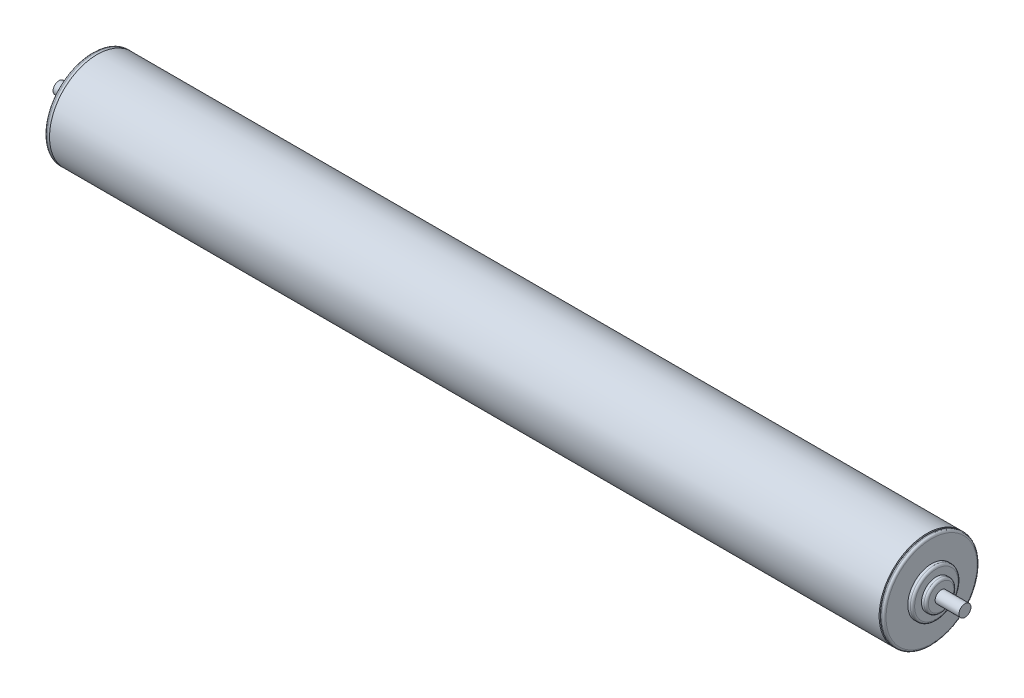
ISO-10303-21;
HEADER;
FILE_DESCRIPTION(('STEP AP214'),'2;1');
FILE_NAME('part.step','',(''),(''),'','','');
FILE_SCHEMA(('AUTOMOTIVE_DESIGN { 1 0 10303 214 1 1 1 1 }'));
ENDSEC;
DATA;
#1=APPLICATION_CONTEXT('core data for automotive mechanical design processes');
#2=APPLICATION_PROTOCOL_DEFINITION('international standard','automotive_design',2000,#1);
#3=PRODUCT_CONTEXT('',#1,'mechanical');
#4=PRODUCT('Part','Part','',(#3));
#5=PRODUCT_RELATED_PRODUCT_CATEGORY('part','',(#4));
#6=PRODUCT_DEFINITION_FORMATION('','',#4);
#7=PRODUCT_DEFINITION_CONTEXT('part definition',#1,'design');
#8=PRODUCT_DEFINITION('design','',#6,#7);
#9=PRODUCT_DEFINITION_SHAPE('','',#8);
#10=(LENGTH_UNIT() NAMED_UNIT(*) SI_UNIT(.MILLI.,.METRE.));
#11=(NAMED_UNIT(*) PLANE_ANGLE_UNIT() SI_UNIT($,.RADIAN.));
#12=(NAMED_UNIT(*) SI_UNIT($,.STERADIAN.) SOLID_ANGLE_UNIT());
#13=UNCERTAINTY_MEASURE_WITH_UNIT(LENGTH_MEASURE(1.E-05),#10,'distance_accuracy_value','');
#14=(GEOMETRIC_REPRESENTATION_CONTEXT(3) GLOBAL_UNCERTAINTY_ASSIGNED_CONTEXT((#13)) GLOBAL_UNIT_ASSIGNED_CONTEXT((#10,
#11,#12)) REPRESENTATION_CONTEXT('',''));
#15=CARTESIAN_POINT('',(0.,0.,0.));
#16=DIRECTION('',(0.,0.,1.));
#17=DIRECTION('',(1.,0.,0.));
#18=AXIS2_PLACEMENT_3D('',#15,#16,#17);
#19=CARTESIAN_POINT('',(-228.6,0.,0.));
#20=DIRECTION('',(1.,0.,0.));
#21=DIRECTION('',(0.,0.,-1.));
#22=AXIS2_PLACEMENT_3D('',#19,#20,#21);
#23=PLANE('',#22);
#24=CARTESIAN_POINT('',(-228.6,0.,0.));
#25=DIRECTION('',(1.,0.,0.));
#26=DIRECTION('',(0.,0.,-1.));
#27=AXIS2_PLACEMENT_3D('',#24,#25,#26);
#28=CIRCLE('',#27,6.79450000000001);
#29=CARTESIAN_POINT('',(-228.6,0.,-6.79450000000001));
#30=VERTEX_POINT('',#29);
#31=EDGE_CURVE('E47',#30,#30,#28,.F.);
#32=ORIENTED_EDGE('',*,*,#31,.T.);
#33=EDGE_LOOP('',(#32));
#34=FACE_BOUND('',#33,.T.);
#35=CARTESIAN_POINT('',(-228.6,0.,0.));
#36=DIRECTION('',(1.,0.,0.));
#37=DIRECTION('',(0.,0.,-1.));
#38=AXIS2_PLACEMENT_3D('',#35,#36,#37);
#39=CIRCLE('',#38,3.175);
#40=CARTESIAN_POINT('',(-228.6,0.,-3.175));
#41=VERTEX_POINT('',#40);
#42=EDGE_CURVE('E39',#41,#41,#39,.F.);
#43=ORIENTED_EDGE('',*,*,#42,.F.);
#44=EDGE_LOOP('',(#43));
#45=FACE_BOUND('',#44,.T.);
#46=ADVANCED_FACE('F32',(#34,#45),#23,.F.);
#47=CARTESIAN_POINT('',(-228.6,0.,0.));
#48=DIRECTION('',(-1.,0.,0.));
#49=DIRECTION('',(0.,0.,1.));
#50=AXIS2_PLACEMENT_3D('',#47,#48,#49);
#51=CYLINDRICAL_SURFACE('',#50,7.93750000000001);
#52=CARTESIAN_POINT('',(-227.457,0.,0.));
#53=DIRECTION('',(1.,0.,0.));
#54=DIRECTION('',(0.,0.,-1.));
#55=AXIS2_PLACEMENT_3D('',#52,#53,#54);
#56=CIRCLE('',#55,7.93750000000001);
#57=CARTESIAN_POINT('',(-227.457,0.,-7.93750000000001));
#58=VERTEX_POINT('',#57);
#59=EDGE_CURVE('E43',#58,#58,#56,.T.);
#60=ORIENTED_EDGE('',*,*,#59,.T.);
#61=EDGE_LOOP('',(#60));
#62=FACE_BOUND('',#61,.T.);
#63=CARTESIAN_POINT('',(-226.06,0.,0.));
#64=DIRECTION('',(-1.,0.,0.));
#65=DIRECTION('',(0.,0.,1.));
#66=AXIS2_PLACEMENT_3D('',#63,#64,#65);
#67=CIRCLE('',#66,7.93750000000001);
#68=CARTESIAN_POINT('',(-226.06,0.,7.93750000000001));
#69=VERTEX_POINT('',#68);
#70=EDGE_CURVE('E70',#69,#69,#67,.T.);
#71=ORIENTED_EDGE('',*,*,#70,.T.);
#72=EDGE_LOOP('',(#71));
#73=FACE_BOUND('',#72,.T.);
#74=ADVANCED_FACE('F131',(#62,#73),#51,.T.);
#75=CARTESIAN_POINT('',(-226.06,-7.93750000000001,0.));
#76=DIRECTION('',(1.,0.,0.));
#77=DIRECTION('',(0.,0.,-1.));
#78=AXIS2_PLACEMENT_3D('',#75,#76,#77);
#79=PLANE('',#78);
#80=CARTESIAN_POINT('',(-226.06,0.,0.));
#81=DIRECTION('',(1.,0.,0.));
#82=DIRECTION('',(0.,0.,-1.));
#83=AXIS2_PLACEMENT_3D('',#80,#81,#82);
#84=CIRCLE('',#83,11.557);
#85=CARTESIAN_POINT('',(-226.06,0.,-11.557));
#86=VERTEX_POINT('',#85);
#87=EDGE_CURVE('E55',#86,#86,#84,.F.);
#88=ORIENTED_EDGE('',*,*,#87,.T.);
#89=EDGE_LOOP('',(#88));
#90=FACE_BOUND('',#89,.T.);
#91=ORIENTED_EDGE('',*,*,#70,.F.);
#92=EDGE_LOOP('',(#91));
#93=FACE_BOUND('',#92,.T.);
#94=ADVANCED_FACE('F137',(#90,#93),#79,.F.);
#95=CARTESIAN_POINT('',(-228.6,0.,0.));
#96=DIRECTION('',(-1.,0.,0.));
#97=DIRECTION('',(0.,0.,1.));
#98=AXIS2_PLACEMENT_3D('',#95,#96,#97);
#99=CYLINDRICAL_SURFACE('',#98,12.7);
#100=CARTESIAN_POINT('',(-224.917,0.,0.));
#101=DIRECTION('',(1.,0.,0.));
#102=DIRECTION('',(0.,0.,-1.));
#103=AXIS2_PLACEMENT_3D('',#100,#101,#102);
#104=CIRCLE('',#103,12.7);
#105=CARTESIAN_POINT('',(-224.917,0.,-12.7));
#106=VERTEX_POINT('',#105);
#107=EDGE_CURVE('E52',#106,#106,#104,.T.);
#108=ORIENTED_EDGE('',*,*,#107,.T.);
#109=EDGE_LOOP('',(#108));
#110=FACE_BOUND('',#109,.T.);
#111=CARTESIAN_POINT('',(-223.52,0.,0.));
#112=DIRECTION('',(-1.,0.,0.));
#113=DIRECTION('',(0.,0.,1.));
#114=AXIS2_PLACEMENT_3D('',#111,#112,#113);
#115=CIRCLE('',#114,12.7);
#116=CARTESIAN_POINT('',(-223.52,0.,12.7));
#117=VERTEX_POINT('',#116);
#118=EDGE_CURVE('E73',#117,#117,#115,.T.);
#119=ORIENTED_EDGE('',*,*,#118,.T.);
#120=EDGE_LOOP('',(#119));
#121=FACE_BOUND('',#120,.T.);
#122=ADVANCED_FACE('F165',(#110,#121),#99,.T.);
#123=CARTESIAN_POINT('',(-223.52,-12.7,0.));
#124=DIRECTION('',(1.,0.,0.));
#125=DIRECTION('',(0.,0.,-1.));
#126=AXIS2_PLACEMENT_3D('',#123,#124,#125);
#127=PLANE('',#126);
#128=CARTESIAN_POINT('',(-223.52,0.,0.));
#129=DIRECTION('',(1.,0.,0.));
#130=DIRECTION('',(0.,0.,-1.));
#131=AXIS2_PLACEMENT_3D('',#128,#129,#130);
#132=CIRCLE('',#131,24.257);
#133=CARTESIAN_POINT('',(-223.52,0.,-24.257));
#134=VERTEX_POINT('',#133);
#135=EDGE_CURVE('E58',#134,#134,#132,.F.);
#136=ORIENTED_EDGE('',*,*,#135,.T.);
#137=EDGE_LOOP('',(#136));
#138=FACE_BOUND('',#137,.T.);
#139=ORIENTED_EDGE('',*,*,#118,.F.);
#140=EDGE_LOOP('',(#139));
#141=FACE_BOUND('',#140,.T.);
#142=ADVANCED_FACE('F171',(#138,#141),#127,.F.);
#143=CARTESIAN_POINT('',(-228.6,0.,0.));
#144=DIRECTION('',(-1.,0.,0.));
#145=DIRECTION('',(0.,0.,1.));
#146=AXIS2_PLACEMENT_3D('',#143,#144,#145);
#147=CYLINDRICAL_SURFACE('',#146,25.4);
#148=CARTESIAN_POINT('',(-222.123,0.,0.));
#149=DIRECTION('',(-1.,0.,0.));
#150=DIRECTION('',(0.,0.,1.));
#151=AXIS2_PLACEMENT_3D('',#148,#149,#150);
#152=CIRCLE('',#151,25.4);
#153=CARTESIAN_POINT('',(-222.123,0.,25.4));
#154=VERTEX_POINT('',#153);
#155=EDGE_CURVE('E64',#154,#154,#152,.T.);
#156=ORIENTED_EDGE('',*,*,#155,.T.);
#157=EDGE_LOOP('',(#156));
#158=FACE_BOUND('',#157,.T.);
#159=CARTESIAN_POINT('',(-222.377,0.,0.));
#160=DIRECTION('',(1.,0.,0.));
#161=DIRECTION('',(0.,0.,-1.));
#162=AXIS2_PLACEMENT_3D('',#159,#160,#161);
#163=CIRCLE('',#162,25.4);
#164=CARTESIAN_POINT('',(-222.377,0.,-25.4));
#165=VERTEX_POINT('',#164);
#166=EDGE_CURVE('E67',#165,#165,#163,.T.);
#167=ORIENTED_EDGE('',*,*,#166,.T.);
#168=EDGE_LOOP('',(#167));
#169=FACE_BOUND('',#168,.T.);
#170=ADVANCED_FACE('F147',(#158,#169),#147,.T.);
#171=CARTESIAN_POINT('',(-222.123,0.,0.));
#172=DIRECTION('',(-1.,0.,0.));
#173=DIRECTION('',(0.,0.,1.));
#174=AXIS2_PLACEMENT_3D('',#171,#172,#173);
#175=TOROIDAL_SURFACE('',#174,24.257,1.143);
#176=CARTESIAN_POINT('',(-220.98,0.,0.));
#177=DIRECTION('',(-1.,0.,0.));
#178=DIRECTION('',(0.,0.,1.));
#179=AXIS2_PLACEMENT_3D('',#176,#177,#178);
#180=CIRCLE('',#179,24.257);
#181=CARTESIAN_POINT('',(-220.98,0.,24.257));
#182=VERTEX_POINT('',#181);
#183=EDGE_CURVE('E61',#182,#182,#180,.F.);
#184=ORIENTED_EDGE('',*,*,#183,.F.);
#185=EDGE_LOOP('',(#184));
#186=FACE_BOUND('',#185,.T.);
#187=ORIENTED_EDGE('',*,*,#155,.F.);
#188=EDGE_LOOP('',(#187));
#189=FACE_BOUND('',#188,.T.);
#190=ADVANCED_FACE('F143',(#186,#189),#175,.T.);
#191=CARTESIAN_POINT('',(-222.377,0.,0.));
#192=DIRECTION('',(1.,0.,0.));
#193=DIRECTION('',(0.,0.,-1.));
#194=AXIS2_PLACEMENT_3D('',#191,#192,#193);
#195=TOROIDAL_SURFACE('',#194,24.257,1.143);
#196=ORIENTED_EDGE('',*,*,#166,.F.);
#197=EDGE_LOOP('',(#196));
#198=FACE_BOUND('',#197,.T.);
#199=ORIENTED_EDGE('',*,*,#135,.F.);
#200=EDGE_LOOP('',(#199));
#201=FACE_BOUND('',#200,.T.);
#202=ADVANCED_FACE('F146',(#198,#201),#195,.T.);
#203=CARTESIAN_POINT('',(-224.917,0.,0.));
#204=DIRECTION('',(1.,0.,0.));
#205=DIRECTION('',(0.,0.,-1.));
#206=AXIS2_PLACEMENT_3D('',#203,#204,#205);
#207=TOROIDAL_SURFACE('',#206,11.557,1.143);
#208=ORIENTED_EDGE('',*,*,#107,.F.);
#209=EDGE_LOOP('',(#208));
#210=FACE_BOUND('',#209,.T.);
#211=ORIENTED_EDGE('',*,*,#87,.F.);
#212=EDGE_LOOP('',(#211));
#213=FACE_BOUND('',#212,.T.);
#214=ADVANCED_FACE('F150',(#210,#213),#207,.T.);
#215=CARTESIAN_POINT('',(-227.457,0.,0.));
#216=DIRECTION('',(1.,0.,0.));
#217=DIRECTION('',(0.,0.,-1.));
#218=AXIS2_PLACEMENT_3D('',#215,#216,#217);
#219=TOROIDAL_SURFACE('',#218,6.79450000000001,1.143);
#220=ORIENTED_EDGE('',*,*,#59,.F.);
#221=EDGE_LOOP('',(#220));
#222=FACE_BOUND('',#221,.T.);
#223=ORIENTED_EDGE('',*,*,#31,.F.);
#224=EDGE_LOOP('',(#223));
#225=FACE_BOUND('',#224,.T.);
#226=ADVANCED_FACE('F34',(#222,#225),#219,.T.);
#227=CARTESIAN_POINT('',(-241.3,0.,0.));
#228=DIRECTION('',(1.,0.,0.));
#229=DIRECTION('',(0.,0.,-1.));
#230=AXIS2_PLACEMENT_3D('',#227,#228,#229);
#231=CYLINDRICAL_SURFACE('',#230,3.175);
#232=CARTESIAN_POINT('',(-241.3,0.,0.));
#233=DIRECTION('',(-1.,0.,0.));
#234=DIRECTION('',(0.,0.,1.));
#235=AXIS2_PLACEMENT_3D('',#232,#233,#234);
#236=CIRCLE('',#235,3.175);
#237=CARTESIAN_POINT('',(-241.3,0.,3.175));
#238=VERTEX_POINT('',#237);
#239=EDGE_CURVE('E76',#238,#238,#236,.T.);
#240=ORIENTED_EDGE('',*,*,#239,.F.);
#241=EDGE_LOOP('',(#240));
#242=FACE_BOUND('',#241,.T.);
#243=ORIENTED_EDGE('',*,*,#42,.T.);
#244=EDGE_LOOP('',(#243));
#245=FACE_BOUND('',#244,.T.);
#246=ADVANCED_FACE('F157',(#242,#245),#231,.T.);
#247=CARTESIAN_POINT('',(-241.3,0.,0.));
#248=DIRECTION('',(-1.,0.,0.));
#249=DIRECTION('',(0.,0.,1.));
#250=AXIS2_PLACEMENT_3D('',#247,#248,#249);
#251=PLANE('',#250);
#252=ORIENTED_EDGE('',*,*,#239,.T.);
#253=EDGE_LOOP('',(#252));
#254=FACE_BOUND('',#253,.T.);
#255=ADVANCED_FACE('F183',(#254),#251,.T.);
#256=CARTESIAN_POINT('',(-220.98,-25.4,1.77367252013231E-13));
#257=DIRECTION('',(-1.,0.,0.));
#258=DIRECTION('',(0.,0.,1.));
#259=AXIS2_PLACEMENT_3D('',#256,#257,#258);
#260=PLANE('',#259);
#261=ORIENTED_EDGE('',*,*,#183,.T.);
#262=EDGE_LOOP('',(#261));
#263=FACE_BOUND('',#262,.T.);
#264=CARTESIAN_POINT('',(-220.98,0.,0.));
#265=DIRECTION('',(-1.,0.,0.));
#266=DIRECTION('',(0.,0.,1.));
#267=AXIS2_PLACEMENT_3D('',#264,#265,#266);
#268=CIRCLE('',#267,25.4);
#269=CARTESIAN_POINT('',(-220.98,0.,25.4));
#270=VERTEX_POINT('',#269);
#271=EDGE_CURVE('E79',#270,#270,#268,.F.);
#272=ORIENTED_EDGE('',*,*,#271,.F.);
#273=EDGE_LOOP('',(#272));
#274=FACE_BOUND('',#273,.T.);
#275=ADVANCED_FACE('F187',(#263,#274),#260,.T.);
#276=CARTESIAN_POINT('',(-292.822048968553,0.,0.));
#277=DIRECTION('',(1.,0.,0.));
#278=DIRECTION('',(0.,0.,-1.));
#279=AXIS2_PLACEMENT_3D('',#276,#277,#278);
#280=CYLINDRICAL_SURFACE('',#279,25.4);
#281=ORIENTED_EDGE('',*,*,#271,.T.);
#282=EDGE_LOOP('',(#281));
#283=FACE_BOUND('',#282,.T.);
#284=CARTESIAN_POINT('',(220.98,0.,0.));
#285=DIRECTION('',(1.,0.,0.));
#286=DIRECTION('',(0.,0.,-1.));
#287=AXIS2_PLACEMENT_3D('',#284,#285,#286);
#288=CIRCLE('',#287,25.4);
#289=CARTESIAN_POINT('',(220.98,0.,-25.4));
#290=VERTEX_POINT('',#289);
#291=EDGE_CURVE('E82',#290,#290,#288,.T.);
#292=ORIENTED_EDGE('',*,*,#291,.F.);
#293=EDGE_LOOP('',(#292));
#294=FACE_BOUND('',#293,.T.);
#295=ADVANCED_FACE('F191',(#283,#294),#280,.T.);
#296=CARTESIAN_POINT('',(220.98,-25.4,1.77367252013231E-13));
#297=DIRECTION('',(1.,0.,0.));
#298=DIRECTION('',(0.,0.,1.));
#299=AXIS2_PLACEMENT_3D('',#296,#297,#298);
#300=PLANE('',#299);
#301=CARTESIAN_POINT('',(220.98,0.,0.));
#302=DIRECTION('',(1.,0.,0.));
#303=DIRECTION('',(0.,0.,-1.));
#304=AXIS2_PLACEMENT_3D('',#301,#302,#303);
#305=CIRCLE('',#304,24.257);
#306=CARTESIAN_POINT('',(220.98,0.,-24.257));
#307=VERTEX_POINT('',#306);
#308=EDGE_CURVE('E10',#307,#307,#305,.T.);
#309=ORIENTED_EDGE('',*,*,#308,.F.);
#310=EDGE_LOOP('',(#309));
#311=FACE_BOUND('',#310,.T.);
#312=ORIENTED_EDGE('',*,*,#291,.T.);
#313=EDGE_LOOP('',(#312));
#314=FACE_BOUND('',#313,.T.);
#315=ADVANCED_FACE('F195',(#311,#314),#300,.T.);
#316=CARTESIAN_POINT('',(228.6,0.,0.));
#317=DIRECTION('',(-1.,0.,0.));
#318=DIRECTION('',(0.,0.,-1.));
#319=AXIS2_PLACEMENT_3D('',#316,#317,#318);
#320=PLANE('',#319);
#321=CARTESIAN_POINT('',(228.6,0.,0.));
#322=DIRECTION('',(1.,0.,0.));
#323=DIRECTION('',(0.,0.,-1.));
#324=AXIS2_PLACEMENT_3D('',#321,#322,#323);
#325=CIRCLE('',#324,6.79450000000001);
#326=CARTESIAN_POINT('',(228.6,0.,-6.79450000000001));
#327=VERTEX_POINT('',#326);
#328=EDGE_CURVE('E91',#327,#327,#325,.F.);
#329=ORIENTED_EDGE('',*,*,#328,.F.);
#330=EDGE_LOOP('',(#329));
#331=FACE_BOUND('',#330,.T.);
#332=CARTESIAN_POINT('',(228.6,0.,0.));
#333=DIRECTION('',(1.,0.,0.));
#334=DIRECTION('',(0.,0.,-1.));
#335=AXIS2_PLACEMENT_3D('',#332,#333,#334);
#336=CIRCLE('',#335,3.175);
#337=CARTESIAN_POINT('',(228.6,0.,-3.175));
#338=VERTEX_POINT('',#337);
#339=EDGE_CURVE('E85',#338,#338,#336,.F.);
#340=ORIENTED_EDGE('',*,*,#339,.T.);
#341=EDGE_LOOP('',(#340));
#342=FACE_BOUND('',#341,.T.);
#343=ADVANCED_FACE('F199',(#331,#342),#320,.F.);
#344=CARTESIAN_POINT('',(228.6,0.,0.));
#345=DIRECTION('',(1.,0.,0.));
#346=DIRECTION('',(0.,0.,1.));
#347=AXIS2_PLACEMENT_3D('',#344,#345,#346);
#348=CYLINDRICAL_SURFACE('',#347,7.93750000000001);
#349=CARTESIAN_POINT('',(227.457,0.,0.));
#350=DIRECTION('',(1.,0.,0.));
#351=DIRECTION('',(0.,0.,-1.));
#352=AXIS2_PLACEMENT_3D('',#349,#350,#351);
#353=CIRCLE('',#352,7.93750000000001);
#354=CARTESIAN_POINT('',(227.457,0.,-7.93750000000001));
#355=VERTEX_POINT('',#354);
#356=EDGE_CURVE('E88',#355,#355,#353,.T.);
#357=ORIENTED_EDGE('',*,*,#356,.F.);
#358=EDGE_LOOP('',(#357));
#359=FACE_BOUND('',#358,.T.);
#360=CARTESIAN_POINT('',(226.06,0.,0.));
#361=DIRECTION('',(-1.,0.,0.));
#362=DIRECTION('',(0.,0.,1.));
#363=AXIS2_PLACEMENT_3D('',#360,#361,#362);
#364=CIRCLE('',#363,7.93750000000001);
#365=CARTESIAN_POINT('',(226.06,0.,7.93750000000001));
#366=VERTEX_POINT('',#365);
#367=EDGE_CURVE('E109',#366,#366,#364,.T.);
#368=ORIENTED_EDGE('',*,*,#367,.F.);
#369=EDGE_LOOP('',(#368));
#370=FACE_BOUND('',#369,.T.);
#371=ADVANCED_FACE('F218',(#359,#370),#348,.T.);
#372=CARTESIAN_POINT('',(226.06,-7.93750000000001,0.));
#373=DIRECTION('',(-1.,0.,0.));
#374=DIRECTION('',(0.,0.,-1.));
#375=AXIS2_PLACEMENT_3D('',#372,#373,#374);
#376=PLANE('',#375);
#377=CARTESIAN_POINT('',(226.06,0.,0.));
#378=DIRECTION('',(1.,0.,0.));
#379=DIRECTION('',(0.,0.,-1.));
#380=AXIS2_PLACEMENT_3D('',#377,#378,#379);
#381=CIRCLE('',#380,11.557);
#382=CARTESIAN_POINT('',(226.06,0.,-11.557));
#383=VERTEX_POINT('',#382);
#384=EDGE_CURVE('E97',#383,#383,#381,.F.);
#385=ORIENTED_EDGE('',*,*,#384,.F.);
#386=EDGE_LOOP('',(#385));
#387=FACE_BOUND('',#386,.T.);
#388=ORIENTED_EDGE('',*,*,#367,.T.);
#389=EDGE_LOOP('',(#388));
#390=FACE_BOUND('',#389,.T.);
#391=ADVANCED_FACE('F222',(#387,#390),#376,.F.);
#392=CARTESIAN_POINT('',(228.6,0.,0.));
#393=DIRECTION('',(1.,0.,0.));
#394=DIRECTION('',(0.,0.,1.));
#395=AXIS2_PLACEMENT_3D('',#392,#393,#394);
#396=CYLINDRICAL_SURFACE('',#395,12.7);
#397=CARTESIAN_POINT('',(224.917,0.,0.));
#398=DIRECTION('',(1.,0.,0.));
#399=DIRECTION('',(0.,0.,-1.));
#400=AXIS2_PLACEMENT_3D('',#397,#398,#399);
#401=CIRCLE('',#400,12.7);
#402=CARTESIAN_POINT('',(224.917,0.,-12.7));
#403=VERTEX_POINT('',#402);
#404=EDGE_CURVE('E94',#403,#403,#401,.T.);
#405=ORIENTED_EDGE('',*,*,#404,.F.);
#406=EDGE_LOOP('',(#405));
#407=FACE_BOUND('',#406,.T.);
#408=CARTESIAN_POINT('',(223.52,0.,0.));
#409=DIRECTION('',(-1.,0.,0.));
#410=DIRECTION('',(0.,0.,1.));
#411=AXIS2_PLACEMENT_3D('',#408,#409,#410);
#412=CIRCLE('',#411,12.7);
#413=CARTESIAN_POINT('',(223.52,0.,12.7));
#414=VERTEX_POINT('',#413);
#415=EDGE_CURVE('E112',#414,#414,#412,.T.);
#416=ORIENTED_EDGE('',*,*,#415,.F.);
#417=EDGE_LOOP('',(#416));
#418=FACE_BOUND('',#417,.T.);
#419=ADVANCED_FACE('F226',(#407,#418),#396,.T.);
#420=CARTESIAN_POINT('',(223.52,-12.7,0.));
#421=DIRECTION('',(-1.,0.,0.));
#422=DIRECTION('',(0.,0.,-1.));
#423=AXIS2_PLACEMENT_3D('',#420,#421,#422);
#424=PLANE('',#423);
#425=CARTESIAN_POINT('',(223.52,0.,0.));
#426=DIRECTION('',(1.,0.,0.));
#427=DIRECTION('',(0.,0.,-1.));
#428=AXIS2_PLACEMENT_3D('',#425,#426,#427);
#429=CIRCLE('',#428,24.257);
#430=CARTESIAN_POINT('',(223.52,0.,-24.257));
#431=VERTEX_POINT('',#430);
#432=EDGE_CURVE('E100',#431,#431,#429,.F.);
#433=ORIENTED_EDGE('',*,*,#432,.F.);
#434=EDGE_LOOP('',(#433));
#435=FACE_BOUND('',#434,.T.);
#436=ORIENTED_EDGE('',*,*,#415,.T.);
#437=EDGE_LOOP('',(#436));
#438=FACE_BOUND('',#437,.T.);
#439=ADVANCED_FACE('F230',(#435,#438),#424,.F.);
#440=CARTESIAN_POINT('',(228.6,0.,0.));
#441=DIRECTION('',(1.,0.,0.));
#442=DIRECTION('',(0.,0.,1.));
#443=AXIS2_PLACEMENT_3D('',#440,#441,#442);
#444=CYLINDRICAL_SURFACE('',#443,25.4);
#445=CARTESIAN_POINT('',(222.123,0.,0.));
#446=DIRECTION('',(-1.,0.,0.));
#447=DIRECTION('',(0.,0.,1.));
#448=AXIS2_PLACEMENT_3D('',#445,#446,#447);
#449=CIRCLE('',#448,25.4);
#450=CARTESIAN_POINT('',(222.123,0.,25.4));
#451=VERTEX_POINT('',#450);
#452=EDGE_CURVE('E103',#451,#451,#449,.T.);
#453=ORIENTED_EDGE('',*,*,#452,.F.);
#454=EDGE_LOOP('',(#453));
#455=FACE_BOUND('',#454,.T.);
#456=CARTESIAN_POINT('',(222.377,0.,0.));
#457=DIRECTION('',(1.,0.,0.));
#458=DIRECTION('',(0.,0.,-1.));
#459=AXIS2_PLACEMENT_3D('',#456,#457,#458);
#460=CIRCLE('',#459,25.4);
#461=CARTESIAN_POINT('',(222.377,0.,-25.4));
#462=VERTEX_POINT('',#461);
#463=EDGE_CURVE('E106',#462,#462,#460,.T.);
#464=ORIENTED_EDGE('',*,*,#463,.F.);
#465=EDGE_LOOP('',(#464));
#466=FACE_BOUND('',#465,.T.);
#467=ADVANCED_FACE('F215',(#455,#466),#444,.T.);
#468=CARTESIAN_POINT('',(222.123,0.,0.));
#469=DIRECTION('',(1.,0.,0.));
#470=DIRECTION('',(0.,0.,1.));
#471=AXIS2_PLACEMENT_3D('',#468,#469,#470);
#472=TOROIDAL_SURFACE('',#471,24.257,1.143);
#473=ORIENTED_EDGE('',*,*,#308,.T.);
#474=EDGE_LOOP('',(#473));
#475=FACE_BOUND('',#474,.T.);
#476=ORIENTED_EDGE('',*,*,#452,.T.);
#477=EDGE_LOOP('',(#476));
#478=FACE_BOUND('',#477,.T.);
#479=ADVANCED_FACE('F211',(#475,#478),#472,.T.);
#480=CARTESIAN_POINT('',(222.377,0.,0.));
#481=DIRECTION('',(-1.,0.,0.));
#482=DIRECTION('',(0.,0.,-1.));
#483=AXIS2_PLACEMENT_3D('',#480,#481,#482);
#484=TOROIDAL_SURFACE('',#483,24.257,1.143);
#485=ORIENTED_EDGE('',*,*,#463,.T.);
#486=EDGE_LOOP('',(#485));
#487=FACE_BOUND('',#486,.T.);
#488=ORIENTED_EDGE('',*,*,#432,.T.);
#489=EDGE_LOOP('',(#488));
#490=FACE_BOUND('',#489,.T.);
#491=ADVANCED_FACE('F207',(#487,#490),#484,.T.);
#492=CARTESIAN_POINT('',(224.917,0.,0.));
#493=DIRECTION('',(-1.,0.,0.));
#494=DIRECTION('',(0.,0.,-1.));
#495=AXIS2_PLACEMENT_3D('',#492,#493,#494);
#496=TOROIDAL_SURFACE('',#495,11.557,1.143);
#497=ORIENTED_EDGE('',*,*,#404,.T.);
#498=EDGE_LOOP('',(#497));
#499=FACE_BOUND('',#498,.T.);
#500=ORIENTED_EDGE('',*,*,#384,.T.);
#501=EDGE_LOOP('',(#500));
#502=FACE_BOUND('',#501,.T.);
#503=ADVANCED_FACE('F203',(#499,#502),#496,.T.);
#504=CARTESIAN_POINT('',(227.457,0.,0.));
#505=DIRECTION('',(-1.,0.,0.));
#506=DIRECTION('',(0.,0.,-1.));
#507=AXIS2_PLACEMENT_3D('',#504,#505,#506);
#508=TOROIDAL_SURFACE('',#507,6.79450000000001,1.143);
#509=ORIENTED_EDGE('',*,*,#356,.T.);
#510=EDGE_LOOP('',(#509));
#511=FACE_BOUND('',#510,.T.);
#512=ORIENTED_EDGE('',*,*,#328,.T.);
#513=EDGE_LOOP('',(#512));
#514=FACE_BOUND('',#513,.T.);
#515=ADVANCED_FACE('F128',(#511,#514),#508,.T.);
#516=CARTESIAN_POINT('',(241.3,0.,0.));
#517=DIRECTION('',(-1.,0.,0.));
#518=DIRECTION('',(0.,0.,-1.));
#519=AXIS2_PLACEMENT_3D('',#516,#517,#518);
#520=CYLINDRICAL_SURFACE('',#519,3.175);
#521=CARTESIAN_POINT('',(241.3,0.,0.));
#522=DIRECTION('',(-1.,0.,0.));
#523=DIRECTION('',(0.,0.,1.));
#524=AXIS2_PLACEMENT_3D('',#521,#522,#523);
#525=CIRCLE('',#524,3.175);
#526=CARTESIAN_POINT('',(241.3,0.,3.175));
#527=VERTEX_POINT('',#526);
#528=EDGE_CURVE('E115',#527,#527,#525,.T.);
#529=ORIENTED_EDGE('',*,*,#528,.T.);
#530=EDGE_LOOP('',(#529));
#531=FACE_BOUND('',#530,.T.);
#532=ORIENTED_EDGE('',*,*,#339,.F.);
#533=EDGE_LOOP('',(#532));
#534=FACE_BOUND('',#533,.T.);
#535=ADVANCED_FACE('F119',(#531,#534),#520,.T.);
#536=CARTESIAN_POINT('',(241.3,0.,0.));
#537=DIRECTION('',(1.,0.,0.));
#538=DIRECTION('',(0.,0.,1.));
#539=AXIS2_PLACEMENT_3D('',#536,#537,#538);
#540=PLANE('',#539);
#541=ORIENTED_EDGE('',*,*,#528,.F.);
#542=EDGE_LOOP('',(#541));
#543=FACE_BOUND('',#542,.T.);
#544=ADVANCED_FACE('F122',(#543),#540,.T.);
#545=CLOSED_SHELL('',(#46,#74,#94,#122,#142,#170,#190,#202,#214,#226,#246,#255,#275,#295,#315,
#343,#371,#391,#419,#439,#467,#479,#491,#503,#515,#535,#544));
#546=MANIFOLD_SOLID_BREP('B2',#545);
#547=ADVANCED_BREP_SHAPE_REPRESENTATION('',(#18,#546),#14);
#548=SHAPE_DEFINITION_REPRESENTATION(#9,#547);
ENDSEC;
END-ISO-10303-21;
